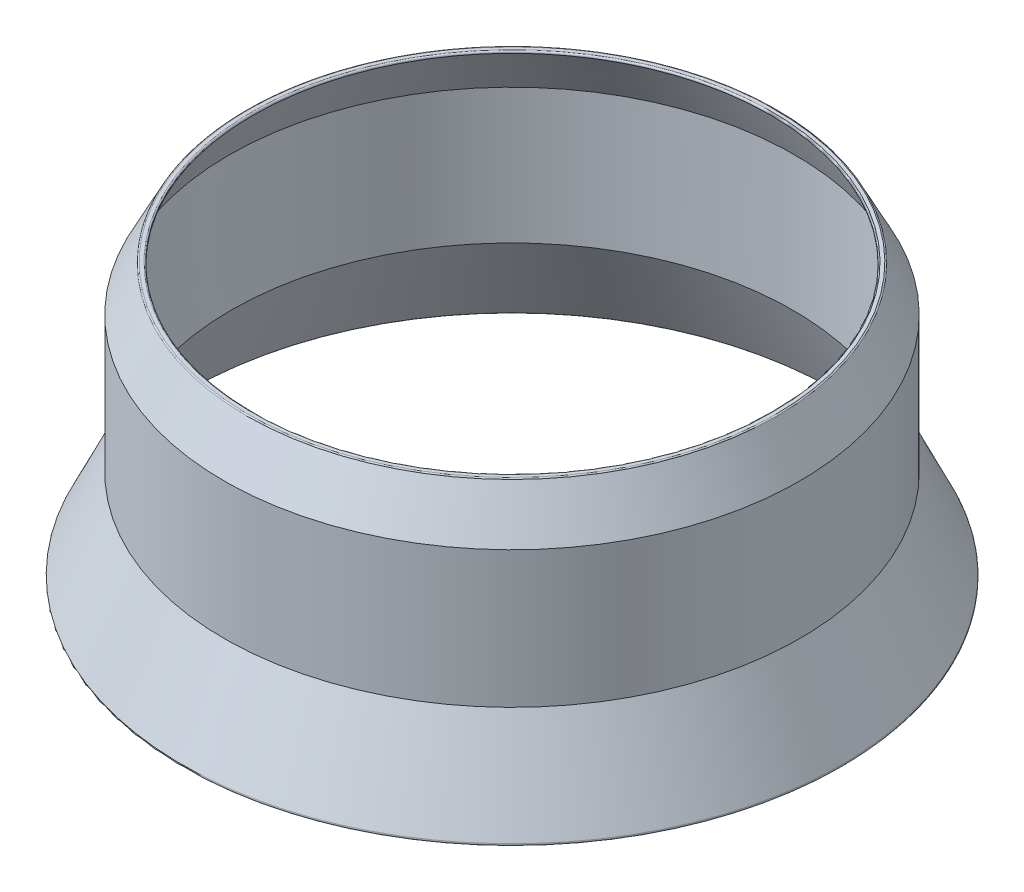
ISO-10303-21;
HEADER;
FILE_DESCRIPTION(('STEP AP214'),'2;1');
FILE_NAME('part.step','',(''),(''),'','','');
FILE_SCHEMA(('AUTOMOTIVE_DESIGN { 1 0 10303 214 1 1 1 1 }'));
ENDSEC;
DATA;
#1=APPLICATION_CONTEXT('core data for automotive mechanical design processes');
#2=APPLICATION_PROTOCOL_DEFINITION('international standard','automotive_design',2000,#1);
#3=PRODUCT_CONTEXT('',#1,'mechanical');
#4=PRODUCT('Part','Part','',(#3));
#5=PRODUCT_RELATED_PRODUCT_CATEGORY('part','',(#4));
#6=PRODUCT_DEFINITION_FORMATION('','',#4);
#7=PRODUCT_DEFINITION_CONTEXT('part definition',#1,'design');
#8=PRODUCT_DEFINITION('design','',#6,#7);
#9=PRODUCT_DEFINITION_SHAPE('','',#8);
#10=(LENGTH_UNIT() NAMED_UNIT(*) SI_UNIT(.MILLI.,.METRE.));
#11=(NAMED_UNIT(*) PLANE_ANGLE_UNIT() SI_UNIT($,.RADIAN.));
#12=(NAMED_UNIT(*) SI_UNIT($,.STERADIAN.) SOLID_ANGLE_UNIT());
#13=UNCERTAINTY_MEASURE_WITH_UNIT(LENGTH_MEASURE(1.E-05),#10,'distance_accuracy_value','');
#14=(GEOMETRIC_REPRESENTATION_CONTEXT(3) GLOBAL_UNCERTAINTY_ASSIGNED_CONTEXT((#13)) GLOBAL_UNIT_ASSIGNED_CONTEXT((#10,
#11,#12)) REPRESENTATION_CONTEXT('',''));
#15=CARTESIAN_POINT('',(0.,0.,0.));
#16=DIRECTION('',(0.,0.,1.));
#17=DIRECTION('',(1.,0.,0.));
#18=AXIS2_PLACEMENT_3D('',#15,#16,#17);
#19=CARTESIAN_POINT('',(-17.4496374616753,-0.18269182435416,0.));
#20=DIRECTION('',(0.,-1.,0.));
#21=DIRECTION('',(1.,0.,0.));
#22=AXIS2_PLACEMENT_3D('',#19,#20,#21);
#23=CONICAL_SURFACE('',#22,17.0937952251236,0.474315434428903);
#24=CARTESIAN_POINT('',(-17.4496374616753,-0.145672956088541,0.));
#25=DIRECTION('',(0.,1.,0.));
#26=DIRECTION('',(-1.,0.,0.));
#27=AXIS2_PLACEMENT_3D('',#24,#25,#26);
#28=CIRCLE('',#27,17.074789486388);
#29=CARTESIAN_POINT('',(-34.5244269480634,-0.145672956088543,0.));
#30=VERTEX_POINT('',#29);
#31=EDGE_CURVE('E59',#30,#30,#28,.T.);
#32=ORIENTED_EDGE('',*,*,#31,.T.);
#33=EDGE_LOOP('',(#32));
#34=FACE_BOUND('',#33,.T.);
#35=CARTESIAN_POINT('',(-17.4496374616753,-3.18269182435416,0.));
#36=DIRECTION('',(0.,1.,0.));
#37=DIRECTION('',(-1.,0.,0.));
#38=AXIS2_PLACEMENT_3D('',#35,#36,#37);
#39=CIRCLE('',#38,18.6340156283381);
#40=CARTESIAN_POINT('',(-36.0836530900134,-3.18269182435416,0.));
#41=VERTEX_POINT('',#40);
#42=EDGE_CURVE('E62',#41,#41,#39,.T.);
#43=ORIENTED_EDGE('',*,*,#42,.F.);
#44=EDGE_LOOP('',(#43));
#45=FACE_BOUND('',#44,.T.);
#46=ADVANCED_FACE('F30',(#34,#45),#23,.F.);
#47=CARTESIAN_POINT('',(-17.4496374616753,-3.18269182435416,0.));
#48=DIRECTION('',(0.,1.,0.));
#49=DIRECTION('',(-1.,0.,0.));
#50=AXIS2_PLACEMENT_3D('',#47,#48,#49);
#51=CONICAL_SURFACE('',#50,18.6340156283381,0.012591426453714);
#52=CARTESIAN_POINT('',(-17.4496374616753,-12.,0.));
#53=DIRECTION('',(0.,1.,0.));
#54=DIRECTION('',(-1.,0.,0.));
#55=AXIS2_PLACEMENT_3D('',#52,#53,#54);
#56=CIRCLE('',#55,18.5229872732354);
#57=CARTESIAN_POINT('',(-35.9726247349107,-12.,0.));
#58=VERTEX_POINT('',#57);
#59=EDGE_CURVE('E65',#58,#58,#56,.T.);
#60=ORIENTED_EDGE('',*,*,#59,.F.);
#61=EDGE_LOOP('',(#60));
#62=FACE_BOUND('',#61,.T.);
#63=ORIENTED_EDGE('',*,*,#42,.T.);
#64=EDGE_LOOP('',(#63));
#65=FACE_BOUND('',#64,.T.);
#66=ADVANCED_FACE('F94',(#62,#65),#51,.F.);
#67=CARTESIAN_POINT('',(-17.4496374616753,-12.,0.));
#68=DIRECTION('',(0.,-1.,0.));
#69=DIRECTION('',(1.,0.,0.));
#70=AXIS2_PLACEMENT_3D('',#67,#68,#69);
#71=CONICAL_SURFACE('',#70,18.5229872732354,0.436332312998587);
#72=CARTESIAN_POINT('',(-17.4496374616753,-17.9422618261741,0.));
#73=DIRECTION('',(0.,1.,0.));
#74=DIRECTION('',(-1.,0.,0.));
#75=AXIS2_PLACEMENT_3D('',#72,#73,#74);
#76=CIRCLE('',#75,21.2939094695425);
#77=CARTESIAN_POINT('',(-38.7435469312178,-17.9422618261741,0.));
#78=VERTEX_POINT('',#77);
#79=EDGE_CURVE('E37',#78,#78,#76,.F.);
#80=ORIENTED_EDGE('',*,*,#79,.T.);
#81=EDGE_LOOP('',(#80));
#82=FACE_BOUND('',#81,.T.);
#83=ORIENTED_EDGE('',*,*,#59,.T.);
#84=EDGE_LOOP('',(#83));
#85=FACE_BOUND('',#84,.T.);
#86=ADVANCED_FACE('F90',(#82,#85),#71,.F.);
#87=CARTESIAN_POINT('',(3.87119576049012,-18.,0.));
#88=DIRECTION('',(0.,1.,0.));
#89=DIRECTION('',(-1.,0.,0.));
#90=AXIS2_PLACEMENT_3D('',#87,#88,#89);
#91=PLANE('',#90);
#92=CARTESIAN_POINT('',(-17.4496374616753,-18.,0.));
#93=DIRECTION('',(0.,1.,0.));
#94=DIRECTION('',(-1.,0.,0.));
#95=AXIS2_PLACEMENT_3D('',#92,#93,#94);
#96=CIRCLE('',#95,21.3845402482462);
#97=CARTESIAN_POINT('',(-38.8341777099215,-18.,0.));
#98=VERTEX_POINT('',#97);
#99=EDGE_CURVE('E41',#98,#98,#96,.T.);
#100=ORIENTED_EDGE('',*,*,#99,.T.);
#101=EDGE_LOOP('',(#100));
#102=FACE_BOUND('',#101,.T.);
#103=CARTESIAN_POINT('',(-17.4496374616753,-18.,0.));
#104=DIRECTION('',(0.,1.,0.));
#105=DIRECTION('',(-1.,0.,0.));
#106=AXIS2_PLACEMENT_3D('',#103,#104,#105);
#107=CIRCLE('',#106,21.6307352561081);
#108=CARTESIAN_POINT('',(-39.0803727177834,-18.,0.));
#109=VERTEX_POINT('',#108);
#110=EDGE_CURVE('E45',#109,#109,#107,.F.);
#111=ORIENTED_EDGE('',*,*,#110,.T.);
#112=EDGE_LOOP('',(#111));
#113=FACE_BOUND('',#112,.T.);
#114=ADVANCED_FACE('F85',(#102,#113),#91,.F.);
#115=CARTESIAN_POINT('',(-17.4496374616753,-18.,0.));
#116=DIRECTION('',(0.,-1.,0.));
#117=DIRECTION('',(1.,0.,0.));
#118=AXIS2_PLACEMENT_3D('',#115,#116,#117);
#119=CONICAL_SURFACE('',#118,21.7877038138198,0.436332312998587);
#120=CARTESIAN_POINT('',(-17.4496374616753,-17.8577381738259,0.));
#121=DIRECTION('',(0.,1.,0.));
#122=DIRECTION('',(-1.,0.,0.));
#123=AXIS2_PLACEMENT_3D('',#120,#121,#122);
#124=CIRCLE('',#123,21.7213660348117);
#125=CARTESIAN_POINT('',(-39.1710034964871,-17.8577381738259,0.));
#126=VERTEX_POINT('',#125);
#127=EDGE_CURVE('E10',#126,#126,#124,.T.);
#128=ORIENTED_EDGE('',*,*,#127,.T.);
#129=EDGE_LOOP('',(#128));
#130=FACE_BOUND('',#129,.T.);
#131=CARTESIAN_POINT('',(-17.4496374616753,-12.,0.));
#132=DIRECTION('',(0.,1.,0.));
#133=DIRECTION('',(-1.,0.,0.));
#134=AXIS2_PLACEMENT_3D('',#131,#132,#133);
#135=CIRCLE('',#134,18.9898578648898);
#136=CARTESIAN_POINT('',(-36.4394953265651,-12.,0.));
#137=VERTEX_POINT('',#136);
#138=EDGE_CURVE('E68',#137,#137,#135,.T.);
#139=ORIENTED_EDGE('',*,*,#138,.F.);
#140=EDGE_LOOP('',(#139));
#141=FACE_BOUND('',#140,.T.);
#142=ADVANCED_FACE('F80',(#130,#141),#119,.T.);
#143=CARTESIAN_POINT('',(-17.4496374616753,4.84281940761424,0.));
#144=DIRECTION('',(0.,1.,0.));
#145=DIRECTION('',(-1.,0.,0.));
#146=AXIS2_PLACEMENT_3D('',#143,#144,#145);
#147=CYLINDRICAL_SURFACE('',#146,18.9898578648898);
#148=CARTESIAN_POINT('',(-17.4496374616753,-3.,0.));
#149=DIRECTION('',(0.,1.,0.));
#150=DIRECTION('',(-1.,0.,0.));
#151=AXIS2_PLACEMENT_3D('',#148,#149,#150);
#152=CIRCLE('',#151,18.9898578648898);
#153=CARTESIAN_POINT('',(-36.4394953265651,-3.,0.));
#154=VERTEX_POINT('',#153);
#155=EDGE_CURVE('E71',#154,#154,#152,.T.);
#156=ORIENTED_EDGE('',*,*,#155,.F.);
#157=EDGE_LOOP('',(#156));
#158=FACE_BOUND('',#157,.T.);
#159=ORIENTED_EDGE('',*,*,#138,.T.);
#160=EDGE_LOOP('',(#159));
#161=FACE_BOUND('',#160,.T.);
#162=ADVANCED_FACE('F77',(#158,#161),#147,.T.);
#163=CARTESIAN_POINT('',(-17.4496374616753,-3.,0.));
#164=DIRECTION('',(0.,-1.,0.));
#165=DIRECTION('',(1.,0.,0.));
#166=AXIS2_PLACEMENT_3D('',#163,#164,#165);
#167=CONICAL_SURFACE('',#166,18.9898578648898,0.474315434428902);
#168=CARTESIAN_POINT('',(-17.4496374616753,-0.0543270439114646,0.));
#169=DIRECTION('',(0.,1.,0.));
#170=DIRECTION('',(-1.,0.,0.));
#171=AXIS2_PLACEMENT_3D('',#168,#169,#170);
#172=CIRCLE('',#171,17.4775293355016);
#173=CARTESIAN_POINT('',(-34.9271667971769,-0.0543270439114666,0.));
#174=VERTEX_POINT('',#173);
#175=EDGE_CURVE('E50',#174,#174,#172,.F.);
#176=ORIENTED_EDGE('',*,*,#175,.T.);
#177=EDGE_LOOP('',(#176));
#178=FACE_BOUND('',#177,.T.);
#179=ORIENTED_EDGE('',*,*,#155,.T.);
#180=EDGE_LOOP('',(#179));
#181=FACE_BOUND('',#180,.T.);
#182=ADVANCED_FACE('F75',(#178,#181),#167,.T.);
#183=CARTESIAN_POINT('',(0.,0.,0.));
#184=DIRECTION('',(0.,-1.,0.));
#185=DIRECTION('',(1.,0.,0.));
#186=AXIS2_PLACEMENT_3D('',#183,#184,#185);
#187=PLANE('',#186);
#188=CARTESIAN_POINT('',(-17.4496374616753,0.,0.));
#189=DIRECTION('',(0.,-1.,0.));
#190=DIRECTION('',(1.,0.,0.));
#191=AXIS2_PLACEMENT_3D('',#188,#189,#190);
#192=CIRCLE('',#191,17.163750045526);
#193=CARTESIAN_POINT('',(-0.285887416149353,0.,0.));
#194=VERTEX_POINT('',#193);
#195=EDGE_CURVE('E53',#194,#194,#192,.T.);
#196=ORIENTED_EDGE('',*,*,#195,.T.);
#197=EDGE_LOOP('',(#196));
#198=FACE_BOUND('',#197,.T.);
#199=CARTESIAN_POINT('',(-17.4496374616753,0.,0.));
#200=DIRECTION('',(0.,-1.,0.));
#201=DIRECTION('',(1.,0.,0.));
#202=AXIS2_PLACEMENT_3D('',#199,#200,#201);
#203=CIRCLE('',#202,17.3885687763636);
#204=CARTESIAN_POINT('',(-0.0610686853116868,0.,0.));
#205=VERTEX_POINT('',#204);
#206=EDGE_CURVE('E56',#205,#205,#203,.F.);
#207=ORIENTED_EDGE('',*,*,#206,.T.);
#208=EDGE_LOOP('',(#207));
#209=FACE_BOUND('',#208,.T.);
#210=ADVANCED_FACE('F109',(#198,#209),#187,.F.);
#211=CARTESIAN_POINT('',(-17.4496374616753,-0.100000000000002,0.));
#212=DIRECTION('',(0.,-1.,0.));
#213=DIRECTION('',(1.,0.,0.));
#214=AXIS2_PLACEMENT_3D('',#211,#212,#213);
#215=TOROIDAL_SURFACE('',#214,17.163750045526,0.1);
#216=ORIENTED_EDGE('',*,*,#195,.F.);
#217=EDGE_LOOP('',(#216));
#218=FACE_BOUND('',#217,.T.);
#219=ORIENTED_EDGE('',*,*,#31,.F.);
#220=EDGE_LOOP('',(#219));
#221=FACE_BOUND('',#220,.T.);
#222=ADVANCED_FACE('F105',(#218,#221),#215,.T.);
#223=CARTESIAN_POINT('',(-17.4496374616753,-0.100000000000002,0.));
#224=DIRECTION('',(0.,-1.,0.));
#225=DIRECTION('',(1.,0.,0.));
#226=AXIS2_PLACEMENT_3D('',#223,#224,#225);
#227=TOROIDAL_SURFACE('',#226,17.3885687763636,0.1);
#228=ORIENTED_EDGE('',*,*,#175,.F.);
#229=EDGE_LOOP('',(#228));
#230=FACE_BOUND('',#229,.T.);
#231=ORIENTED_EDGE('',*,*,#206,.F.);
#232=EDGE_LOOP('',(#231));
#233=FACE_BOUND('',#232,.T.);
#234=ADVANCED_FACE('F108',(#230,#233),#227,.T.);
#235=CARTESIAN_POINT('',(-17.4496374616753,-17.9,0.));
#236=DIRECTION('',(0.,1.,0.));
#237=DIRECTION('',(-1.,0.,0.));
#238=AXIS2_PLACEMENT_3D('',#235,#236,#237);
#239=TOROIDAL_SURFACE('',#238,21.3845402482462,0.1);
#240=ORIENTED_EDGE('',*,*,#79,.F.);
#241=EDGE_LOOP('',(#240));
#242=FACE_BOUND('',#241,.T.);
#243=ORIENTED_EDGE('',*,*,#99,.F.);
#244=EDGE_LOOP('',(#243));
#245=FACE_BOUND('',#244,.T.);
#246=ADVANCED_FACE('F112',(#242,#245),#239,.T.);
#247=CARTESIAN_POINT('',(-17.4496374616753,-17.9,0.));
#248=DIRECTION('',(0.,1.,0.));
#249=DIRECTION('',(-1.,0.,0.));
#250=AXIS2_PLACEMENT_3D('',#247,#248,#249);
#251=TOROIDAL_SURFACE('',#250,21.6307352561081,0.1);
#252=ORIENTED_EDGE('',*,*,#110,.F.);
#253=EDGE_LOOP('',(#252));
#254=FACE_BOUND('',#253,.T.);
#255=ORIENTED_EDGE('',*,*,#127,.F.);
#256=EDGE_LOOP('',(#255));
#257=FACE_BOUND('',#256,.T.);
#258=ADVANCED_FACE('F32',(#254,#257),#251,.T.);
#259=CLOSED_SHELL('',(#46,#66,#86,#114,#142,#162,#182,#210,#222,#234,#246,#258));
#260=MANIFOLD_SOLID_BREP('B2',#259);
#261=ADVANCED_BREP_SHAPE_REPRESENTATION('',(#18,#260),#14);
#262=SHAPE_DEFINITION_REPRESENTATION(#9,#261);
ENDSEC;
END-ISO-10303-21;
